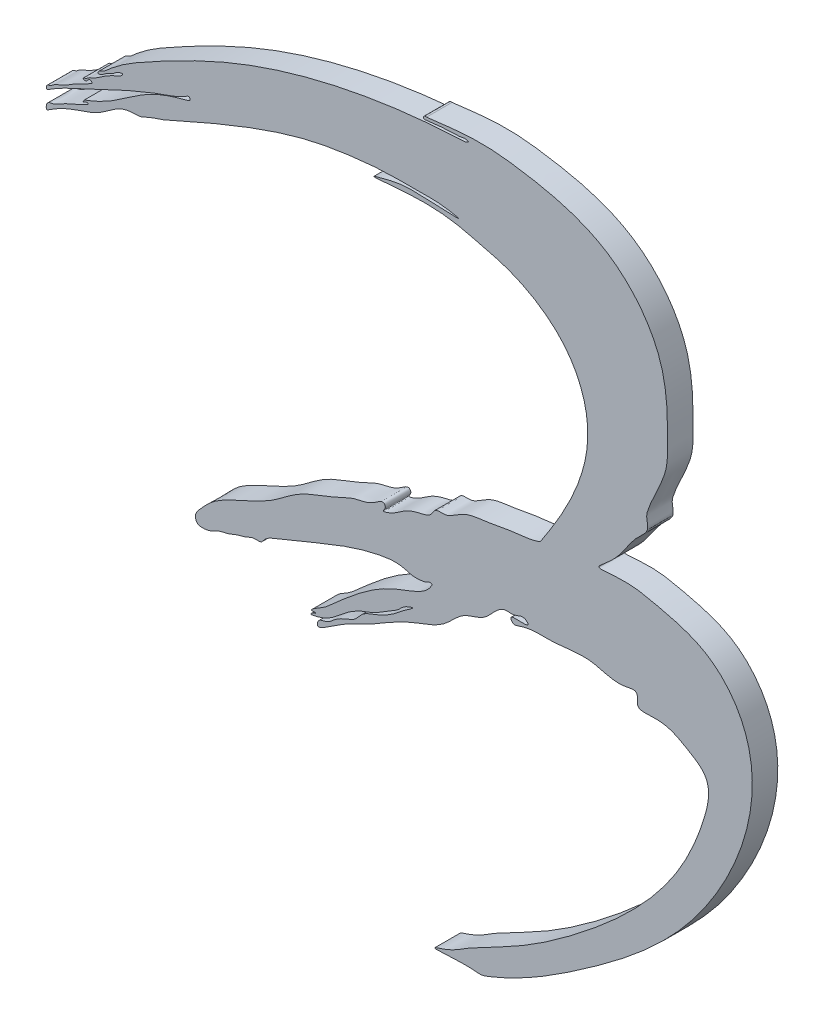
ISO-10303-21;
HEADER;
FILE_DESCRIPTION(('STEP AP214'),'2;1');
FILE_NAME('part.step','',(''),(''),'','','');
FILE_SCHEMA(('AUTOMOTIVE_DESIGN { 1 0 10303 214 1 1 1 1 }'));
ENDSEC;
DATA;
#1=APPLICATION_CONTEXT('core data for automotive mechanical design processes');
#2=APPLICATION_PROTOCOL_DEFINITION('international standard','automotive_design',2000,#1);
#3=PRODUCT_CONTEXT('',#1,'mechanical');
#4=PRODUCT('Part','Part','',(#3));
#5=PRODUCT_RELATED_PRODUCT_CATEGORY('part','',(#4));
#6=PRODUCT_DEFINITION_FORMATION('','',#4);
#7=PRODUCT_DEFINITION_CONTEXT('part definition',#1,'design');
#8=PRODUCT_DEFINITION('design','',#6,#7);
#9=PRODUCT_DEFINITION_SHAPE('','',#8);
#10=(LENGTH_UNIT() NAMED_UNIT(*) SI_UNIT(.MILLI.,.METRE.));
#11=(NAMED_UNIT(*) PLANE_ANGLE_UNIT() SI_UNIT($,.RADIAN.));
#12=(NAMED_UNIT(*) SI_UNIT($,.STERADIAN.) SOLID_ANGLE_UNIT());
#13=UNCERTAINTY_MEASURE_WITH_UNIT(LENGTH_MEASURE(1.E-05),#10,'distance_accuracy_value','');
#14=(GEOMETRIC_REPRESENTATION_CONTEXT(3) GLOBAL_UNCERTAINTY_ASSIGNED_CONTEXT((#13)) GLOBAL_UNIT_ASSIGNED_CONTEXT((#10,
#11,#12)) REPRESENTATION_CONTEXT('',''));
#15=CARTESIAN_POINT('',(0.,0.,0.));
#16=DIRECTION('',(0.,0.,1.));
#17=DIRECTION('',(1.,0.,0.));
#18=AXIS2_PLACEMENT_3D('',#15,#16,#17);
#19=CARTESIAN_POINT('',(15.1995015960389,5.19827013041804,3.));
#20=CARTESIAN_POINT('',(14.0958419529117,4.77396464165727,3.));
#21=CARTESIAN_POINT('',(11.9604295702762,4.71700979871829,3.));
#22=CARTESIAN_POINT('',(9.04787784690259,4.03560954435328,3.));
#23=CARTESIAN_POINT('',(6.52701310831833,3.87514311975151,3.));
#24=CARTESIAN_POINT('',(5.08191790555502,2.77374857367592,3.));
#25=CARTESIAN_POINT('',(3.93437140903093,2.2472457065042,3.));
#26=CARTESIAN_POINT('',(2.83011020224383,2.49890461831288,3.));
#27=CARTESIAN_POINT('',(2.36343260888996,1.30102953735953,3.));
#28=CARTESIAN_POINT('',(0.980198169077803,1.04895765775036,3.));
#29=CARTESIAN_POINT('',(-0.361872164064922,0.658241757764914,3.));
#30=CARTESIAN_POINT('',(-1.54804995635484,-0.183676376246237,3.));
#31=CARTESIAN_POINT('',(-2.19080340579083,-0.623235529355932,3.));
#32=CARTESIAN_POINT('',(-3.49299745831042,-1.06341475325133,3.));
#33=CARTESIAN_POINT('',(-2.91035248697116,-0.473377103082553,3.));
#34=CARTESIAN_POINT('',(-3.25038249949013,0.283024267710963,3.));
#35=CARTESIAN_POINT('',(-4.74300043955382,-1.07041505874894,3.));
#36=CARTESIAN_POINT('',(-6.62450668627817,-1.14249000049053,3.));
#37=CARTESIAN_POINT('',(-9.54150942046386,-2.72369646453109,3.));
#38=CARTESIAN_POINT('',(-13.0438725816569,-3.71720716387772,3.));
#39=CARTESIAN_POINT('',(-16.4090161860015,-6.66693622101617,3.));
#40=CARTESIAN_POINT('',(-20.0785110549887,-8.19699622163524,3.));
#41=CARTESIAN_POINT('',(-23.1946449837552,-9.69219821046574,3.));
#42=CARTESIAN_POINT('',(-24.5632220703858,-11.219945232225,3.));
#43=CARTESIAN_POINT('',(-25.4534214001273,-12.2065421290322,3.));
#44=CARTESIAN_POINT('',(-25.189023581123,-13.2096424038821,3.));
#45=CARTESIAN_POINT('',(-24.2647949861478,-13.2590205484727,3.));
#46=CARTESIAN_POINT('',(-23.3744817108042,-13.0606184347443,3.));
#47=CARTESIAN_POINT('',(-22.5545442981302,-12.5094396821662,3.));
#48=CARTESIAN_POINT('',(-21.420659909171,-12.376879658255,3.));
#49=CARTESIAN_POINT('',(-20.4958724052703,-11.8673714595925,3.));
#50=CARTESIAN_POINT('',(-19.3591896466576,-11.6660803361883,3.));
#51=CARTESIAN_POINT('',(-18.5537286594742,-11.1393079986086,3.));
#52=CARTESIAN_POINT('',(-17.6045090947666,-11.3772015076029,3.));
#53=CARTESIAN_POINT('',(-17.0866096849368,-10.5268866259645,3.));
#54=CARTESIAN_POINT('',(-15.1627246731678,-9.67361335865382,3.));
#55=CARTESIAN_POINT('',(-12.2172011838243,-8.53256594330222,3.));
#56=CARTESIAN_POINT('',(-8.05242348929606,-6.77304132352672,3.));
#57=CARTESIAN_POINT('',(-4.70448220639067,-5.71450819966082,3.));
#58=CARTESIAN_POINT('',(-2.06545377276401,-5.33522280448841,3.));
#59=CARTESIAN_POINT('',(-0.890788082645844,-5.42422225033863,3.));
#60=CARTESIAN_POINT('',(0.165009296190616,-5.81629201322624,3.));
#61=CARTESIAN_POINT('',(1.01124391583894,-5.76477608315352,3.));
#62=CARTESIAN_POINT('',(1.77711742775109,-5.67160042402953,3.));
#63=CARTESIAN_POINT('',(2.1035218855577,-5.35129102693235,3.));
#64=CARTESIAN_POINT('',(2.54953335853164,-5.45695972790596,3.));
#65=CARTESIAN_POINT('',(2.44625385237584,-5.62819552641706,3.));
#66=CARTESIAN_POINT('',(1.70468517378065,-6.95367896137805,3.));
#67=CARTESIAN_POINT('',(-2.32027920612268,-7.97560562476735,3.));
#68=CARTESIAN_POINT('',(-5.88242315110808,-10.4215725069074,3.));
#69=CARTESIAN_POINT('',(-8.58883850901547,-12.7742820257972,3.));
#70=CARTESIAN_POINT('',(-9.94585289846344,-14.0580035368671,3.));
#71=CARTESIAN_POINT('',(-10.9893006072624,-14.6309310794799,3.));
#72=CARTESIAN_POINT('',(-11.4147740086981,-14.907996669536,3.));
#73=CARTESIAN_POINT('',(-11.7803508659922,-15.2215829170252,3.));
#74=CARTESIAN_POINT('',(-11.4298349846787,-15.2538070675923,3.));
#75=CARTESIAN_POINT('',(-11.1862667639597,-15.1240886407105,3.));
#76=CARTESIAN_POINT('',(-11.2219141704161,-15.2912729898175,3.));
#77=B_SPLINE_CURVE_WITH_KNOTS('',3,(#19,#20,#21,#22,#23,#24,#25,#26,#27,#28,#29,#30,#31,#32,#33,
#34,#35,#36,#37,#38,#39,#40,#41,#42,#43,#44,#45,#46,#47,#48,#49,#50,#51,#52,#53,#54,#55,#56,#57,
#58,#59,#60,#61,#62,#63,#64,#65,#66,#67,#68,#69,#70,#71,#72,#73,#74,#75,#76),.UNSPECIFIED.,.F.,
.F.,(4,1,1,1,1,1,1,1,1,1,1,1,1,1,1,1,1,1,1,1,1,1,1,1,1,1,1,1,1,1,1,1,1,1,1,1,1,1,1,1,1,1,1,1,1,
1,1,1,1,1,1,1,1,1,1,4),(0.,0.0373110627141742,0.0671326128410842,0.0960530611719841,
0.115115706979997,0.123614158999246,0.136472614642831,0.143884529489868,0.159430477340161,
0.176825140254549,0.190211299430557,0.202319091711633,0.209924827147937,0.215168899995614,
0.218733740369436,0.232064775653565,0.25724223153123,0.286307385677385,0.332908069728579,
0.373258477766286,0.42579286996391,0.460063918038159,0.480885925202107,0.492042326306139,
0.499948532211395,0.507555739327661,0.517950483230059,0.529650547844752,0.537979896244193,
0.553818862893404,0.562715519574904,0.574430158171982,0.58371541189597,0.588441223917766,
0.603705009344641,0.64918787612356,0.690357062010263,0.747621402912072,0.76055054634767,
0.775211357613802,0.784692780123921,0.795926456972487,0.802181514557666,0.808231097726299,
0.81072967879181,0.811964274735067,0.813512594249906,0.861480588275613,0.925965587076256,
0.956206121477471,0.974515004402209,0.986662787159862,0.991349586606959,0.994374230531627,
0.996165229166199,1.),.UNSPECIFIED.);
#78=DIRECTION('',(0.,0.,-1.));
#79=VECTOR('',#78,1.);
#80=SURFACE_OF_LINEAR_EXTRUSION('',#77,#79);
#81=CARTESIAN_POINT('',(15.1995015960389,5.19827013041804,0.));
#82=CARTESIAN_POINT('',(14.0958419529117,4.77396464165727,0.));
#83=CARTESIAN_POINT('',(11.9604295702762,4.71700979871829,0.));
#84=CARTESIAN_POINT('',(9.04787784690259,4.03560954435328,0.));
#85=CARTESIAN_POINT('',(6.52701310831833,3.87514311975151,0.));
#86=CARTESIAN_POINT('',(5.08191790555502,2.77374857367592,0.));
#87=CARTESIAN_POINT('',(3.93437140903093,2.2472457065042,0.));
#88=CARTESIAN_POINT('',(2.83011020224383,2.49890461831288,0.));
#89=CARTESIAN_POINT('',(2.36343260888996,1.30102953735953,0.));
#90=CARTESIAN_POINT('',(0.980198169077803,1.04895765775036,0.));
#91=CARTESIAN_POINT('',(-0.361872164064922,0.658241757764914,0.));
#92=CARTESIAN_POINT('',(-1.54804995635484,-0.183676376246237,0.));
#93=CARTESIAN_POINT('',(-2.19080340579083,-0.623235529355932,0.));
#94=CARTESIAN_POINT('',(-3.49299745831042,-1.06341475325133,0.));
#95=CARTESIAN_POINT('',(-2.91035248697116,-0.473377103082553,0.));
#96=CARTESIAN_POINT('',(-3.25038249949013,0.283024267710963,0.));
#97=CARTESIAN_POINT('',(-4.74300043955382,-1.07041505874894,0.));
#98=CARTESIAN_POINT('',(-6.62450668627817,-1.14249000049053,0.));
#99=CARTESIAN_POINT('',(-9.54150942046386,-2.72369646453109,0.));
#100=CARTESIAN_POINT('',(-13.0438725816569,-3.71720716387772,0.));
#101=CARTESIAN_POINT('',(-16.4090161860015,-6.66693622101617,0.));
#102=CARTESIAN_POINT('',(-20.0785110549887,-8.19699622163524,0.));
#103=CARTESIAN_POINT('',(-23.1946449837552,-9.69219821046574,0.));
#104=CARTESIAN_POINT('',(-24.5632220703858,-11.219945232225,0.));
#105=CARTESIAN_POINT('',(-25.4534214001273,-12.2065421290322,0.));
#106=CARTESIAN_POINT('',(-25.189023581123,-13.2096424038821,0.));
#107=CARTESIAN_POINT('',(-24.2647949861478,-13.2590205484727,0.));
#108=CARTESIAN_POINT('',(-23.3744817108042,-13.0606184347443,0.));
#109=CARTESIAN_POINT('',(-22.5545442981302,-12.5094396821662,0.));
#110=CARTESIAN_POINT('',(-21.420659909171,-12.376879658255,0.));
#111=CARTESIAN_POINT('',(-20.4958724052703,-11.8673714595925,0.));
#112=CARTESIAN_POINT('',(-19.3591896466576,-11.6660803361883,0.));
#113=CARTESIAN_POINT('',(-18.5537286594742,-11.1393079986086,0.));
#114=CARTESIAN_POINT('',(-17.6045090947666,-11.3772015076029,0.));
#115=CARTESIAN_POINT('',(-17.0866096849368,-10.5268866259645,0.));
#116=CARTESIAN_POINT('',(-15.1627246731678,-9.67361335865382,0.));
#117=CARTESIAN_POINT('',(-12.2172011838243,-8.53256594330222,0.));
#118=CARTESIAN_POINT('',(-8.05242348929606,-6.77304132352672,0.));
#119=CARTESIAN_POINT('',(-4.70448220639067,-5.71450819966082,0.));
#120=CARTESIAN_POINT('',(-2.06545377276401,-5.33522280448841,0.));
#121=CARTESIAN_POINT('',(-0.890788082645844,-5.42422225033863,0.));
#122=CARTESIAN_POINT('',(0.165009296190616,-5.81629201322624,0.));
#123=CARTESIAN_POINT('',(1.01124391583894,-5.76477608315352,0.));
#124=CARTESIAN_POINT('',(1.77711742775109,-5.67160042402953,0.));
#125=CARTESIAN_POINT('',(2.1035218855577,-5.35129102693235,0.));
#126=CARTESIAN_POINT('',(2.54953335853164,-5.45695972790596,0.));
#127=CARTESIAN_POINT('',(2.44625385237584,-5.62819552641706,0.));
#128=CARTESIAN_POINT('',(1.70468517378065,-6.95367896137805,0.));
#129=CARTESIAN_POINT('',(-2.32027920612268,-7.97560562476735,0.));
#130=CARTESIAN_POINT('',(-5.88242315110808,-10.4215725069074,0.));
#131=CARTESIAN_POINT('',(-8.58883850901547,-12.7742820257972,0.));
#132=CARTESIAN_POINT('',(-9.94585289846344,-14.0580035368671,0.));
#133=CARTESIAN_POINT('',(-10.9893006072624,-14.6309310794799,0.));
#134=CARTESIAN_POINT('',(-11.4147740086981,-14.907996669536,0.));
#135=CARTESIAN_POINT('',(-11.7803508659922,-15.2215829170252,0.));
#136=CARTESIAN_POINT('',(-11.4298349846787,-15.2538070675923,0.));
#137=CARTESIAN_POINT('',(-11.1862667639597,-15.1240886407105,0.));
#138=CARTESIAN_POINT('',(-11.2219141704161,-15.2912729898175,0.));
#139=B_SPLINE_CURVE_WITH_KNOTS('',3,(#81,#82,#83,#84,#85,#86,#87,#88,#89,#90,#91,#92,#93,#94,
#95,#96,#97,#98,#99,#100,#101,#102,#103,#104,#105,#106,#107,#108,#109,#110,#111,#112,#113,#114,
#115,#116,#117,#118,#119,#120,#121,#122,#123,#124,#125,#126,#127,#128,#129,#130,#131,#132,#133,
#134,#135,#136,#137,#138),.UNSPECIFIED.,.F.,.F.,(4,1,1,1,1,1,1,1,1,1,1,1,1,1,1,1,1,1,1,1,1,1,1,
1,1,1,1,1,1,1,1,1,1,1,1,1,1,1,1,1,1,1,1,1,1,1,1,1,1,1,1,1,1,1,1,4),(0.,0.0373110627141742,
0.0671326128410842,0.0960530611719841,0.115115706979997,0.123614158999246,0.136472614642831,
0.143884529489868,0.159430477340161,0.176825140254549,0.190211299430557,0.202319091711633,
0.209924827147937,0.215168899995614,0.218733740369436,0.232064775653565,0.25724223153123,
0.286307385677385,0.332908069728579,0.373258477766286,0.42579286996391,0.460063918038159,
0.480885925202107,0.492042326306139,0.499948532211395,0.507555739327661,0.517950483230059,
0.529650547844752,0.537979896244193,0.553818862893404,0.562715519574904,0.574430158171982,
0.58371541189597,0.588441223917766,0.603705009344641,0.64918787612356,0.690357062010263,
0.747621402912072,0.76055054634767,0.775211357613802,0.784692780123921,0.795926456972487,
0.802181514557666,0.808231097726299,0.81072967879181,0.811964274735067,0.813512594249906,
0.861480588275613,0.925965587076256,0.956206121477471,0.974515004402209,0.986662787159862,
0.991349586606959,0.994374230531627,0.996165229166199,1.),.UNSPECIFIED.);
#140=CARTESIAN_POINT('',(15.1995015960389,5.19827013041804,0.));
#141=VERTEX_POINT('',#140);
#142=CARTESIAN_POINT('',(-11.221914170416,-15.2912729898174,0.));
#143=VERTEX_POINT('',#142);
#144=EDGE_CURVE('E160',#141,#143,#139,.T.);
#145=ORIENTED_EDGE('',*,*,#144,.T.);
#146=DIRECTION('',(0.,0.,-1.));
#147=VECTOR('',#146,1.);
#148=CARTESIAN_POINT('',(-11.221914170416,-15.2912729898174,3.));
#149=LINE('',#148,#147);
#150=CARTESIAN_POINT('',(-11.221914170416,-15.2912729898174,3.));
#151=VERTEX_POINT('',#150);
#152=EDGE_CURVE('E11',#151,#143,#149,.T.);
#153=ORIENTED_EDGE('',*,*,#152,.F.);
#154=CARTESIAN_POINT('',(15.1995015960389,5.19827013041804,3.));
#155=VERTEX_POINT('',#154);
#156=EDGE_CURVE('E132',#155,#151,#77,.T.);
#157=ORIENTED_EDGE('',*,*,#156,.F.);
#158=DIRECTION('',(0.,0.,-1.));
#159=VECTOR('',#158,1.);
#160=CARTESIAN_POINT('',(15.1995015960389,5.19827013041804,3.));
#161=LINE('',#160,#159);
#162=EDGE_CURVE('E104',#155,#141,#161,.T.);
#163=ORIENTED_EDGE('',*,*,#162,.T.);
#164=EDGE_LOOP('',(#145,#153,#157,#163));
#165=FACE_BOUND('',#164,.T.);
#166=ADVANCED_FACE('F33',(#165),#80,.F.);
#167=CARTESIAN_POINT('',(-11.221914170416,-15.2912729898174,3.));
#168=CARTESIAN_POINT('',(-11.5189389147028,-15.4279662597497,3.));
#169=CARTESIAN_POINT('',(-11.5254525217188,-15.3436418587691,3.));
#170=CARTESIAN_POINT('',(-11.8412727920546,-15.7007354015512,3.));
#171=CARTESIAN_POINT('',(-9.50659533725828,-15.3311738858664,3.));
#172=CARTESIAN_POINT('',(-8.41622893654678,-13.8050697630374,3.));
#173=CARTESIAN_POINT('',(-6.00838697655427,-12.3849518994164,3.));
#174=CARTESIAN_POINT('',(-4.13496059091193,-11.8054771202667,3.));
#175=CARTESIAN_POINT('',(-2.83709932965658,-10.8423829067835,3.));
#176=CARTESIAN_POINT('',(-1.39833603207282,-10.0762467828582,3.));
#177=CARTESIAN_POINT('',(-0.903376935939344,-9.34938670262808,3.));
#178=CARTESIAN_POINT('',(0.674975578002253,-8.80771598917175,3.));
#179=CARTESIAN_POINT('',(-1.02731392831293,-9.90382790486688,3.));
#180=CARTESIAN_POINT('',(-1.98193707320999,-10.8062916667545,3.));
#181=CARTESIAN_POINT('',(-3.86523492225404,-11.87561887977,3.));
#182=CARTESIAN_POINT('',(-5.67560417703189,-12.3758327723778,3.));
#183=CARTESIAN_POINT('',(-6.48225912013006,-13.6613219256212,3.));
#184=CARTESIAN_POINT('',(-7.79472109020774,-14.0916867510068,3.));
#185=CARTESIAN_POINT('',(-8.93406368649081,-14.7014686845481,3.));
#186=CARTESIAN_POINT('',(-9.79979626710272,-15.6219981916345,3.));
#187=CARTESIAN_POINT('',(-10.8685329267459,-15.5992016609686,3.));
#188=CARTESIAN_POINT('',(-11.1705494058274,-17.0193212386164,3.));
#189=CARTESIAN_POINT('',(-7.47431086954014,-14.2333126286844,3.));
#190=CARTESIAN_POINT('',(-5.01187801581852,-13.5414085973592,3.));
#191=CARTESIAN_POINT('',(-0.600839715638556,-10.4793844640075,3.));
#192=CARTESIAN_POINT('',(3.69857509671523,-9.52203095359924,3.));
#193=CARTESIAN_POINT('',(6.00859607265713,-6.49032616713004,3.));
#194=CARTESIAN_POINT('',(9.05293409071264,-6.10150546683464,3.));
#195=CARTESIAN_POINT('',(10.3479254439335,-3.53307837301929,3.));
#196=CARTESIAN_POINT('',(12.2506846288754,-3.95538168926402,3.));
#197=CARTESIAN_POINT('',(13.1512682595168,-3.20818858439633,3.));
#198=CARTESIAN_POINT('',(14.0634308772694,-4.0948958699519,3.));
#199=CARTESIAN_POINT('',(12.7327396377202,-4.10705784056804,3.));
#200=CARTESIAN_POINT('',(11.5299214393626,-4.0131400087814,3.));
#201=CARTESIAN_POINT('',(12.049471653755,-4.9091677715443,3.));
#202=CARTESIAN_POINT('',(13.8815600294986,-4.0912771187364,3.));
#203=CARTESIAN_POINT('',(16.7834393887847,-4.46436638409484,3.));
#204=CARTESIAN_POINT('',(21.2176079143435,-3.47339805468218,3.));
#205=CARTESIAN_POINT('',(24.0625462361234,-4.98014961688965,3.));
#206=CARTESIAN_POINT('',(26.5712180730074,-4.17148517881171,3.));
#207=CARTESIAN_POINT('',(26.681847386245,-5.11568379962877,3.));
#208=CARTESIAN_POINT('',(26.5193535224281,-6.23963142168466,3.));
#209=CARTESIAN_POINT('',(29.8199386362207,-5.72246045502405,3.));
#210=CARTESIAN_POINT('',(31.9442438773158,-6.93012012070608,3.));
#211=CARTESIAN_POINT('',(35.5820448130086,-9.07107017063939,3.));
#212=CARTESIAN_POINT('',(33.9289839560056,-16.0266111571874,3.));
#213=CARTESIAN_POINT('',(29.3750335532289,-24.2252762169431,3.));
#214=CARTESIAN_POINT('',(20.5245251812646,-32.0899727106418,3.));
#215=CARTESIAN_POINT('',(12.6535697896943,-37.455394119025,3.));
#216=CARTESIAN_POINT('',(7.03402707498904,-40.0833808790579,3.));
#217=CARTESIAN_POINT('',(4.73864640536638,-41.7174213074878,3.));
#218=CARTESIAN_POINT('',(1.75880281611782,-42.5436819355812,3.));
#219=CARTESIAN_POINT('',(5.50872826726006,-42.2747282896769,3.));
#220=CARTESIAN_POINT('',(6.96849178398661,-42.249871811036,3.));
#221=CARTESIAN_POINT('',(8.25690723821207,-42.4250067341725,3.));
#222=CARTESIAN_POINT('',(12.9895126695055,-40.6185857861391,3.));
#223=CARTESIAN_POINT('',(22.3913867667413,-34.6135419238202,3.));
#224=CARTESIAN_POINT('',(36.1886178459611,-23.566629926596,3.));
#225=CARTESIAN_POINT('',(42.8999015671345,-5.08038222634455,3.));
#226=CARTESIAN_POINT('',(35.0284879122134,4.19723738500187,3.));
#227=CARTESIAN_POINT('',(28.7122198396629,5.62982260987067,3.));
#228=CARTESIAN_POINT('',(25.5807075515508,6.33475332177753,3.));
#229=CARTESIAN_POINT('',(21.5114517749397,5.81991356136106,3.));
#230=CARTESIAN_POINT('',(23.8269878809401,7.58216980754947,3.));
#231=CARTESIAN_POINT('',(25.0043574726073,9.15425369060468,3.));
#232=CARTESIAN_POINT('',(26.4007504601684,11.268224294539,3.));
#233=CARTESIAN_POINT('',(28.1315208536264,12.6636892378337,3.));
#234=CARTESIAN_POINT('',(27.5873972972359,13.8730568166974,3.));
#235=CARTESIAN_POINT('',(28.323879586742,16.3403072862993,3.));
#236=CARTESIAN_POINT('',(30.1589169070215,19.1254859909862,3.));
#237=CARTESIAN_POINT('',(30.1747260721774,24.5163359537617,3.));
#238=CARTESIAN_POINT('',(30.2423610109516,31.0761530037512,3.));
#239=CARTESIAN_POINT('',(23.7545426891301,39.6068391039164,3.));
#240=CARTESIAN_POINT('',(15.3775378111352,41.6003830209233,3.));
#241=CARTESIAN_POINT('',(7.9652278516625,42.5436819355811,3.));
#242=CARTESIAN_POINT('',(4.20180004350573,42.0265488843957,3.));
#243=CARTESIAN_POINT('',(1.83862316989548,41.745802762924,3.));
#244=B_SPLINE_CURVE_WITH_KNOTS('',3,(#167,#168,#169,#170,#171,#172,#173,#174,#175,#176,#177,
#178,#179,#180,#181,#182,#183,#184,#185,#186,#187,#188,#189,#190,#191,#192,#193,#194,#195,#196,
#197,#198,#199,#200,#201,#202,#203,#204,#205,#206,#207,#208,#209,#210,#211,#212,#213,#214,#215,
#216,#217,#218,#219,#220,#221,#222,#223,#224,#225,#226,#227,#228,#229,#230,#231,#232,#233,#234,
#235,#236,#237,#238,#239,#240,#241,#242,#243),.UNSPECIFIED.,.F.,.F.,(4,1,1,1,1,1,1,1,1,1,1,1,1,
1,1,1,1,1,1,1,1,1,1,1,1,1,1,1,1,1,1,1,1,1,1,1,1,1,1,1,1,1,1,1,1,1,1,1,1,1,1,1,1,1,1,1,1,1,1,1,1,
1,1,1,1,1,1,1,1,1,1,1,1,1,4),(0.,0.00173731524768406,0.00249415689392807,0.00312388720845236,
0.0203729555138159,0.0277542138577279,0.032938611005887,0.0420648737710846,0.0457918866472484,
0.050242228136036,0.0533929358544633,0.0571555061634341,0.0633437778138226,0.0724573580782313,
0.0793573047019158,0.0835740670330145,0.0883413104196973,0.0941910483109437,0.0978151364573291,
0.102225639940641,0.103324234259138,0.11168663552729,0.128613965756466,0.146718539721065,
0.165606576677006,0.176758997813101,0.186161810638658,0.197939908750732,0.201137287867106,
0.206525870437159,0.208033129407301,0.211848087912277,0.215663046417252,0.217216693402016,
0.220425155321523,0.234079166336685,0.251949086554245,0.266721954632083,0.271251575046947,
0.2737081066228,0.275573244440685,0.282889663306661,0.297974023872584,0.307836209476271,
0.324630906382037,0.364913089714061,0.417495288428217,0.450972473809697,0.472882612226875,
0.482533458829873,0.487242414667897,0.496684654528719,0.503495758509468,0.50829182718403,
0.509976993942497,0.559555427086604,0.630289727712935,0.711218462108069,0.733900446002565,
0.757756541786665,0.776204067909898,0.781893340738878,0.786182077059615,0.798396566852196,
0.808520406347783,0.814174843335125,0.819827310456346,0.823005040537519,0.843402465968039,
0.849459629494909,0.881026997627402,0.916506526496646,0.958241489364952,0.973312959007756,1.),.UNSPECIFIED.);
#245=DIRECTION('',(0.,0.,-1.));
#246=VECTOR('',#245,1.);
#247=SURFACE_OF_LINEAR_EXTRUSION('',#244,#246);
#248=CARTESIAN_POINT('',(-11.221914170416,-15.2912729898174,0.));
#249=CARTESIAN_POINT('',(-11.5189389147028,-15.4279662597497,0.));
#250=CARTESIAN_POINT('',(-11.5254525217188,-15.3436418587691,0.));
#251=CARTESIAN_POINT('',(-11.8412727920546,-15.7007354015512,0.));
#252=CARTESIAN_POINT('',(-9.50659533725828,-15.3311738858664,0.));
#253=CARTESIAN_POINT('',(-8.41622893654678,-13.8050697630374,0.));
#254=CARTESIAN_POINT('',(-6.00838697655427,-12.3849518994164,0.));
#255=CARTESIAN_POINT('',(-4.13496059091193,-11.8054771202667,0.));
#256=CARTESIAN_POINT('',(-2.83709932965658,-10.8423829067835,0.));
#257=CARTESIAN_POINT('',(-1.39833603207282,-10.0762467828582,0.));
#258=CARTESIAN_POINT('',(-0.903376935939344,-9.34938670262808,0.));
#259=CARTESIAN_POINT('',(0.674975578002253,-8.80771598917175,0.));
#260=CARTESIAN_POINT('',(-1.02731392831293,-9.90382790486688,0.));
#261=CARTESIAN_POINT('',(-1.98193707320999,-10.8062916667545,0.));
#262=CARTESIAN_POINT('',(-3.86523492225404,-11.87561887977,0.));
#263=CARTESIAN_POINT('',(-5.67560417703189,-12.3758327723778,0.));
#264=CARTESIAN_POINT('',(-6.48225912013006,-13.6613219256212,0.));
#265=CARTESIAN_POINT('',(-7.79472109020774,-14.0916867510068,0.));
#266=CARTESIAN_POINT('',(-8.93406368649081,-14.7014686845481,0.));
#267=CARTESIAN_POINT('',(-9.79979626710272,-15.6219981916345,0.));
#268=CARTESIAN_POINT('',(-10.8685329267459,-15.5992016609686,0.));
#269=CARTESIAN_POINT('',(-11.1705494058274,-17.0193212386164,0.));
#270=CARTESIAN_POINT('',(-7.47431086954014,-14.2333126286844,0.));
#271=CARTESIAN_POINT('',(-5.01187801581852,-13.5414085973592,0.));
#272=CARTESIAN_POINT('',(-0.600839715638556,-10.4793844640075,0.));
#273=CARTESIAN_POINT('',(3.69857509671523,-9.52203095359924,0.));
#274=CARTESIAN_POINT('',(6.00859607265713,-6.49032616713004,0.));
#275=CARTESIAN_POINT('',(9.05293409071264,-6.10150546683464,0.));
#276=CARTESIAN_POINT('',(10.3479254439335,-3.53307837301929,0.));
#277=CARTESIAN_POINT('',(12.2506846288754,-3.95538168926402,0.));
#278=CARTESIAN_POINT('',(13.1512682595168,-3.20818858439633,0.));
#279=CARTESIAN_POINT('',(14.0634308772694,-4.0948958699519,0.));
#280=CARTESIAN_POINT('',(12.7327396377202,-4.10705784056804,0.));
#281=CARTESIAN_POINT('',(11.5299214393626,-4.0131400087814,0.));
#282=CARTESIAN_POINT('',(12.049471653755,-4.9091677715443,0.));
#283=CARTESIAN_POINT('',(13.8815600294986,-4.0912771187364,0.));
#284=CARTESIAN_POINT('',(16.7834393887847,-4.46436638409484,0.));
#285=CARTESIAN_POINT('',(21.2176079143435,-3.47339805468218,0.));
#286=CARTESIAN_POINT('',(24.0625462361234,-4.98014961688965,0.));
#287=CARTESIAN_POINT('',(26.5712180730074,-4.17148517881171,0.));
#288=CARTESIAN_POINT('',(26.681847386245,-5.11568379962877,0.));
#289=CARTESIAN_POINT('',(26.5193535224281,-6.23963142168466,0.));
#290=CARTESIAN_POINT('',(29.8199386362207,-5.72246045502405,0.));
#291=CARTESIAN_POINT('',(31.9442438773158,-6.93012012070608,0.));
#292=CARTESIAN_POINT('',(35.5820448130086,-9.07107017063939,0.));
#293=CARTESIAN_POINT('',(33.9289839560056,-16.0266111571874,0.));
#294=CARTESIAN_POINT('',(29.3750335532289,-24.2252762169431,0.));
#295=CARTESIAN_POINT('',(20.5245251812646,-32.0899727106418,0.));
#296=CARTESIAN_POINT('',(12.6535697896943,-37.455394119025,0.));
#297=CARTESIAN_POINT('',(7.03402707498904,-40.0833808790579,0.));
#298=CARTESIAN_POINT('',(4.73864640536638,-41.7174213074878,0.));
#299=CARTESIAN_POINT('',(1.75880281611782,-42.5436819355812,0.));
#300=CARTESIAN_POINT('',(5.50872826726006,-42.2747282896769,0.));
#301=CARTESIAN_POINT('',(6.96849178398661,-42.249871811036,0.));
#302=CARTESIAN_POINT('',(8.25690723821207,-42.4250067341725,0.));
#303=CARTESIAN_POINT('',(12.9895126695055,-40.6185857861391,0.));
#304=CARTESIAN_POINT('',(22.3913867667413,-34.6135419238202,0.));
#305=CARTESIAN_POINT('',(36.1886178459611,-23.566629926596,0.));
#306=CARTESIAN_POINT('',(42.8999015671345,-5.08038222634455,0.));
#307=CARTESIAN_POINT('',(35.0284879122134,4.19723738500187,0.));
#308=CARTESIAN_POINT('',(28.7122198396629,5.62982260987067,0.));
#309=CARTESIAN_POINT('',(25.5807075515508,6.33475332177753,0.));
#310=CARTESIAN_POINT('',(21.5114517749397,5.81991356136106,0.));
#311=CARTESIAN_POINT('',(23.8269878809401,7.58216980754947,0.));
#312=CARTESIAN_POINT('',(25.0043574726073,9.15425369060468,0.));
#313=CARTESIAN_POINT('',(26.4007504601684,11.268224294539,0.));
#314=CARTESIAN_POINT('',(28.1315208536264,12.6636892378337,0.));
#315=CARTESIAN_POINT('',(27.5873972972359,13.8730568166974,0.));
#316=CARTESIAN_POINT('',(28.323879586742,16.3403072862993,0.));
#317=CARTESIAN_POINT('',(30.1589169070215,19.1254859909862,0.));
#318=CARTESIAN_POINT('',(30.1747260721774,24.5163359537617,0.));
#319=CARTESIAN_POINT('',(30.2423610109516,31.0761530037512,0.));
#320=CARTESIAN_POINT('',(23.7545426891301,39.6068391039164,0.));
#321=CARTESIAN_POINT('',(15.3775378111352,41.6003830209233,0.));
#322=CARTESIAN_POINT('',(7.9652278516625,42.5436819355811,0.));
#323=CARTESIAN_POINT('',(4.20180004350573,42.0265488843957,0.));
#324=CARTESIAN_POINT('',(1.83862316989548,41.745802762924,0.));
#325=B_SPLINE_CURVE_WITH_KNOTS('',3,(#248,#249,#250,#251,#252,#253,#254,#255,#256,#257,#258,
#259,#260,#261,#262,#263,#264,#265,#266,#267,#268,#269,#270,#271,#272,#273,#274,#275,#276,#277,
#278,#279,#280,#281,#282,#283,#284,#285,#286,#287,#288,#289,#290,#291,#292,#293,#294,#295,#296,
#297,#298,#299,#300,#301,#302,#303,#304,#305,#306,#307,#308,#309,#310,#311,#312,#313,#314,#315,
#316,#317,#318,#319,#320,#321,#322,#323,#324),.UNSPECIFIED.,.F.,.F.,(4,1,1,1,1,1,1,1,1,1,1,1,1,
1,1,1,1,1,1,1,1,1,1,1,1,1,1,1,1,1,1,1,1,1,1,1,1,1,1,1,1,1,1,1,1,1,1,1,1,1,1,1,1,1,1,1,1,1,1,1,1,
1,1,1,1,1,1,1,1,1,1,1,1,1,4),(0.,0.00173731524768406,0.00249415689392807,0.00312388720845236,
0.0203729555138159,0.0277542138577279,0.032938611005887,0.0420648737710846,0.0457918866472484,
0.050242228136036,0.0533929358544633,0.0571555061634341,0.0633437778138226,0.0724573580782313,
0.0793573047019158,0.0835740670330145,0.0883413104196973,0.0941910483109437,0.0978151364573291,
0.102225639940641,0.103324234259138,0.11168663552729,0.128613965756466,0.146718539721065,
0.165606576677006,0.176758997813101,0.186161810638658,0.197939908750732,0.201137287867106,
0.206525870437159,0.208033129407301,0.211848087912277,0.215663046417252,0.217216693402016,
0.220425155321523,0.234079166336685,0.251949086554245,0.266721954632083,0.271251575046947,
0.2737081066228,0.275573244440685,0.282889663306661,0.297974023872584,0.307836209476271,
0.324630906382037,0.364913089714061,0.417495288428217,0.450972473809697,0.472882612226875,
0.482533458829873,0.487242414667897,0.496684654528719,0.503495758509468,0.50829182718403,
0.509976993942497,0.559555427086604,0.630289727712935,0.711218462108069,0.733900446002565,
0.757756541786665,0.776204067909898,0.781893340738878,0.786182077059615,0.798396566852196,
0.808520406347783,0.814174843335125,0.819827310456346,0.823005040537519,0.843402465968039,
0.849459629494909,0.881026997627402,0.916506526496646,0.958241489364952,0.973312959007756,1.),.UNSPECIFIED.);
#326=CARTESIAN_POINT('',(1.83862316989549,41.745802762924,0.));
#327=VERTEX_POINT('',#326);
#328=EDGE_CURVE('E159',#143,#327,#325,.T.);
#329=ORIENTED_EDGE('',*,*,#328,.T.);
#330=DIRECTION('',(0.,0.,-1.));
#331=VECTOR('',#330,1.);
#332=CARTESIAN_POINT('',(1.83862316989549,41.745802762924,3.));
#333=LINE('',#332,#331);
#334=CARTESIAN_POINT('',(1.83862316989549,41.745802762924,3.));
#335=VERTEX_POINT('',#334);
#336=EDGE_CURVE('E42',#335,#327,#333,.T.);
#337=ORIENTED_EDGE('',*,*,#336,.F.);
#338=EDGE_CURVE('E84',#151,#335,#244,.T.);
#339=ORIENTED_EDGE('',*,*,#338,.F.);
#340=ORIENTED_EDGE('',*,*,#152,.T.);
#341=EDGE_LOOP('',(#329,#337,#339,#340));
#342=FACE_BOUND('',#341,.T.);
#343=ADVANCED_FACE('F127',(#342),#247,.F.);
#344=CARTESIAN_POINT('',(1.83862316989549,41.745802762924,3.));
#345=CARTESIAN_POINT('',(1.6622858762715,41.745802762924,3.));
#346=CARTESIAN_POINT('',(1.55165481795354,41.7597905886907,3.));
#347=CARTESIAN_POINT('',(1.42332824912486,41.4786273441266,3.));
#348=CARTESIAN_POINT('',(1.6078737797498,41.3840833642732,3.));
#349=CARTESIAN_POINT('',(2.67182051288773,41.5875783587048,3.));
#350=CARTESIAN_POINT('',(4.76080381802327,41.6879963129292,3.));
#351=CARTESIAN_POINT('',(4.77463910873505,41.6752678454744,3.));
#352=B_SPLINE_CURVE_WITH_KNOTS('',3,(#344,#345,#346,#347,#348,#349,#350,#351),.UNSPECIFIED.,.F.,
.F.,(4,1,1,1,1,4),(0.,0.0825060917504985,0.133215226776818,0.174158315026388,0.210899239204021,
1.),.UNSPECIFIED.);
#353=DIRECTION('',(0.,0.,-1.));
#354=VECTOR('',#353,1.);
#355=SURFACE_OF_LINEAR_EXTRUSION('',#352,#354);
#356=CARTESIAN_POINT('',(1.83862316989549,41.745802762924,0.));
#357=CARTESIAN_POINT('',(1.6622858762715,41.745802762924,0.));
#358=CARTESIAN_POINT('',(1.55165481795354,41.7597905886907,0.));
#359=CARTESIAN_POINT('',(1.42332824912486,41.4786273441266,0.));
#360=CARTESIAN_POINT('',(1.6078737797498,41.3840833642732,0.));
#361=CARTESIAN_POINT('',(2.67182051288773,41.5875783587048,0.));
#362=CARTESIAN_POINT('',(4.76080381802327,41.6879963129292,0.));
#363=CARTESIAN_POINT('',(4.77463910873505,41.6752678454744,0.));
#364=B_SPLINE_CURVE_WITH_KNOTS('',3,(#356,#357,#358,#359,#360,#361,#362,#363),.UNSPECIFIED.,.F.,
.F.,(4,1,1,1,1,4),(0.,0.0825060917504985,0.133215226776818,0.174158315026388,0.210899239204021,
1.),.UNSPECIFIED.);
#365=CARTESIAN_POINT('',(4.77463910873501,41.6752678454744,0.));
#366=VERTEX_POINT('',#365);
#367=EDGE_CURVE('E99',#327,#366,#364,.T.);
#368=ORIENTED_EDGE('',*,*,#367,.T.);
#369=DIRECTION('',(0.,0.,-1.));
#370=VECTOR('',#369,1.);
#371=CARTESIAN_POINT('',(4.77463910873501,41.6752678454744,3.));
#372=LINE('',#371,#370);
#373=CARTESIAN_POINT('',(4.77463910873501,41.6752678454744,3.));
#374=VERTEX_POINT('',#373);
#375=EDGE_CURVE('E96',#374,#366,#372,.T.);
#376=ORIENTED_EDGE('',*,*,#375,.F.);
#377=EDGE_CURVE('E88',#335,#374,#352,.T.);
#378=ORIENTED_EDGE('',*,*,#377,.F.);
#379=ORIENTED_EDGE('',*,*,#336,.T.);
#380=EDGE_LOOP('',(#368,#376,#378,#379));
#381=FACE_BOUND('',#380,.T.);
#382=ADVANCED_FACE('F97',(#381),#355,.F.);
#383=CARTESIAN_POINT('',(4.77463910873501,41.6752678454744,3.));
#384=CARTESIAN_POINT('',(5.06097920652878,41.7083070875275,3.));
#385=CARTESIAN_POINT('',(5.82291470013701,41.6651505531661,3.));
#386=CARTESIAN_POINT('',(6.34482505756071,41.8830951753097,3.));
#387=CARTESIAN_POINT('',(6.81693483428857,41.7185029012533,3.));
#388=CARTESIAN_POINT('',(6.57330663442508,41.5352558577441,3.));
#389=CARTESIAN_POINT('',(6.3768307377883,41.498112845863,3.));
#390=CARTESIAN_POINT('',(4.57388912045521,41.4197903547801,3.));
#391=CARTESIAN_POINT('',(-4.49586713086853,40.8022086372034,3.));
#392=CARTESIAN_POINT('',(-17.4704433363036,37.9478508683895,3.));
#393=CARTESIAN_POINT('',(-28.9884502268893,32.1303364631588,3.));
#394=CARTESIAN_POINT('',(-34.0123288860627,29.2498971997952,3.));
#395=CARTESIAN_POINT('',(-35.5899052090262,27.873454299659,3.));
#396=CARTESIAN_POINT('',(-36.1706846750749,27.3703622458175,3.));
#397=CARTESIAN_POINT('',(-36.6708793336448,27.2902503953966,3.));
#398=CARTESIAN_POINT('',(-36.801377521324,26.8789232027454,3.));
#399=CARTESIAN_POINT('',(-36.3188986996834,26.8954804358521,3.));
#400=CARTESIAN_POINT('',(-35.9273273088677,27.3907627541308,3.));
#401=CARTESIAN_POINT('',(-34.9214939864112,27.6802126943677,3.));
#402=CARTESIAN_POINT('',(-34.5744835887522,28.2131680136287,3.));
#403=CARTESIAN_POINT('',(-33.7846423784101,28.3325938730294,3.));
#404=CARTESIAN_POINT('',(-34.0914360335709,27.9358394951381,3.));
#405=CARTESIAN_POINT('',(-34.8495328958717,27.6549856389498,3.));
#406=CARTESIAN_POINT('',(-36.0327797086853,27.0208175915366,3.));
#407=CARTESIAN_POINT('',(-37.032948019983,26.2424661000758,3.));
#408=CARTESIAN_POINT('',(-37.8694642045655,25.9445450152169,3.));
#409=CARTESIAN_POINT('',(-38.1499272535662,25.6419395491601,3.));
#410=CARTESIAN_POINT('',(-38.6207042462,25.5703833247246,3.));
#411=CARTESIAN_POINT('',(-38.2784490340423,25.3248682770435,3.));
#412=CARTESIAN_POINT('',(-38.0009330131226,25.5362746218252,3.));
#413=CARTESIAN_POINT('',(-37.7707305380655,25.8764277230248,3.));
#414=CARTESIAN_POINT('',(-37.3581371688816,25.5580942555282,3.));
#415=CARTESIAN_POINT('',(-37.8536374168492,25.3198813462891,3.));
#416=CARTESIAN_POINT('',(-38.4615113872964,24.9110898924138,3.));
#417=CARTESIAN_POINT('',(-39.6988277792529,24.4092151931075,3.));
#418=CARTESIAN_POINT('',(-40.8146030769645,23.5681193976286,3.));
#419=CARTESIAN_POINT('',(-41.8603751743773,23.2955836024323,3.));
#420=CARTESIAN_POINT('',(-42.348259231615,22.7941418714101,3.));
#421=CARTESIAN_POINT('',(-42.8538290738016,22.7923062227483,3.));
#422=CARTESIAN_POINT('',(-42.8741103087588,22.1503913579897,3.));
#423=CARTESIAN_POINT('',(-41.3098698591656,23.1962562356976,3.));
#424=CARTESIAN_POINT('',(-38.8592042846149,24.2229449444338,3.));
#425=CARTESIAN_POINT('',(-34.1379782117243,26.5782704525587,3.));
#426=CARTESIAN_POINT('',(-30.1411160096328,28.2525540632906,3.));
#427=CARTESIAN_POINT('',(-27.3605217446482,29.1655252404159,3.));
#428=CARTESIAN_POINT('',(-26.5075534280876,29.6929952135038,3.));
#429=CARTESIAN_POINT('',(-26.103538738174,29.9304922559699,3.));
#430=CARTESIAN_POINT('',(-25.7879818419114,29.4979553469434,3.));
#431=CARTESIAN_POINT('',(-32.8099206728159,27.8722486441838,3.));
#432=CARTESIAN_POINT('',(-33.1515009064001,25.2716613102999,3.));
#433=CARTESIAN_POINT('',(-38.3786821040045,23.3819707761235,3.));
#434=B_SPLINE_CURVE_WITH_KNOTS('',3,(#383,#384,#385,#386,#387,#388,#389,#390,#391,#392,#393,
#394,#395,#396,#397,#398,#399,#400,#401,#402,#403,#404,#405,#406,#407,#408,#409,#410,#411,#412,
#413,#414,#415,#416,#417,#418,#419,#420,#421,#422,#423,#424,#425,#426,#427,#428,#429,#430,#431,
#432,#433),.UNSPECIFIED.,.F.,.F.,(4,1,1,1,1,1,1,1,1,1,1,1,1,1,1,1,1,1,1,1,1,1,1,1,1,1,1,1,1,1,1,
1,1,1,1,1,1,1,1,1,1,1,1,1,1,1,1,1,4),(0.,0.0114183065529457,0.0186675737254903,
0.0205298343827471,0.0220646414273483,0.0254690561903965,0.0274479867377989,0.0766714196230974,
0.308023088277966,0.426094838312351,0.474335905025616,0.484804499217953,0.490684236102368,
0.49771474424871,0.499162531873214,0.500815924887124,0.508783414540374,0.519536311900476,
0.529047974929038,0.532499189808912,0.534050856591378,0.541052093957214,0.559421303020798,
0.573486851145742,0.580904776310274,0.584897345710172,0.587944165498265,0.589695994539984,
0.594013569644109,0.597250921189483,0.600633747367379,0.603087147968486,0.610231558359883,
0.626251653188634,0.64192814109731,0.653415197552848,0.658369649529797,0.662760573398402,
0.666806825326531,0.669254498736839,0.707798976504085,0.765322389440836,0.821932484501013,
0.845819622563151,0.851361227530017,0.855398360752344,0.856965763332636,0.865152420865945,1.),.UNSPECIFIED.);
#435=DIRECTION('',(0.,0.,-1.));
#436=VECTOR('',#435,1.);
#437=SURFACE_OF_LINEAR_EXTRUSION('',#434,#436);
#438=CARTESIAN_POINT('',(4.77463910873501,41.6752678454744,0.));
#439=CARTESIAN_POINT('',(5.06097920652878,41.7083070875275,0.));
#440=CARTESIAN_POINT('',(5.82291470013701,41.6651505531661,0.));
#441=CARTESIAN_POINT('',(6.34482505756071,41.8830951753097,0.));
#442=CARTESIAN_POINT('',(6.81693483428857,41.7185029012533,0.));
#443=CARTESIAN_POINT('',(6.57330663442508,41.5352558577441,0.));
#444=CARTESIAN_POINT('',(6.3768307377883,41.498112845863,0.));
#445=CARTESIAN_POINT('',(4.57388912045521,41.4197903547801,0.));
#446=CARTESIAN_POINT('',(-4.49586713086853,40.8022086372034,0.));
#447=CARTESIAN_POINT('',(-17.4704433363036,37.9478508683895,0.));
#448=CARTESIAN_POINT('',(-28.9884502268893,32.1303364631588,0.));
#449=CARTESIAN_POINT('',(-34.0123288860627,29.2498971997952,0.));
#450=CARTESIAN_POINT('',(-35.5899052090262,27.873454299659,0.));
#451=CARTESIAN_POINT('',(-36.1706846750749,27.3703622458175,0.));
#452=CARTESIAN_POINT('',(-36.6708793336448,27.2902503953966,0.));
#453=CARTESIAN_POINT('',(-36.801377521324,26.8789232027454,0.));
#454=CARTESIAN_POINT('',(-36.3188986996834,26.8954804358521,0.));
#455=CARTESIAN_POINT('',(-35.9273273088677,27.3907627541308,0.));
#456=CARTESIAN_POINT('',(-34.9214939864112,27.6802126943677,0.));
#457=CARTESIAN_POINT('',(-34.5744835887522,28.2131680136287,0.));
#458=CARTESIAN_POINT('',(-33.7846423784101,28.3325938730294,0.));
#459=CARTESIAN_POINT('',(-34.0914360335709,27.9358394951381,0.));
#460=CARTESIAN_POINT('',(-34.8495328958717,27.6549856389498,0.));
#461=CARTESIAN_POINT('',(-36.0327797086853,27.0208175915366,0.));
#462=CARTESIAN_POINT('',(-37.032948019983,26.2424661000758,0.));
#463=CARTESIAN_POINT('',(-37.8694642045655,25.9445450152169,0.));
#464=CARTESIAN_POINT('',(-38.1499272535662,25.6419395491601,0.));
#465=CARTESIAN_POINT('',(-38.6207042462,25.5703833247246,0.));
#466=CARTESIAN_POINT('',(-38.2784490340423,25.3248682770435,0.));
#467=CARTESIAN_POINT('',(-38.0009330131226,25.5362746218252,0.));
#468=CARTESIAN_POINT('',(-37.7707305380655,25.8764277230248,0.));
#469=CARTESIAN_POINT('',(-37.3581371688816,25.5580942555282,0.));
#470=CARTESIAN_POINT('',(-37.8536374168492,25.3198813462891,0.));
#471=CARTESIAN_POINT('',(-38.4615113872964,24.9110898924138,0.));
#472=CARTESIAN_POINT('',(-39.6988277792529,24.4092151931075,0.));
#473=CARTESIAN_POINT('',(-40.8146030769645,23.5681193976286,0.));
#474=CARTESIAN_POINT('',(-41.8603751743773,23.2955836024323,0.));
#475=CARTESIAN_POINT('',(-42.348259231615,22.7941418714101,0.));
#476=CARTESIAN_POINT('',(-42.8538290738016,22.7923062227483,0.));
#477=CARTESIAN_POINT('',(-42.8741103087588,22.1503913579897,0.));
#478=CARTESIAN_POINT('',(-41.3098698591656,23.1962562356976,0.));
#479=CARTESIAN_POINT('',(-38.8592042846149,24.2229449444338,0.));
#480=CARTESIAN_POINT('',(-34.1379782117243,26.5782704525587,0.));
#481=CARTESIAN_POINT('',(-30.1411160096328,28.2525540632906,0.));
#482=CARTESIAN_POINT('',(-27.3605217446482,29.1655252404159,0.));
#483=CARTESIAN_POINT('',(-26.5075534280876,29.6929952135038,0.));
#484=CARTESIAN_POINT('',(-26.103538738174,29.9304922559699,0.));
#485=CARTESIAN_POINT('',(-25.7879818419114,29.4979553469434,0.));
#486=CARTESIAN_POINT('',(-32.8099206728159,27.8722486441838,0.));
#487=CARTESIAN_POINT('',(-33.1515009064001,25.2716613102999,0.));
#488=CARTESIAN_POINT('',(-38.3786821040045,23.3819707761235,0.));
#489=B_SPLINE_CURVE_WITH_KNOTS('',3,(#438,#439,#440,#441,#442,#443,#444,#445,#446,#447,#448,
#449,#450,#451,#452,#453,#454,#455,#456,#457,#458,#459,#460,#461,#462,#463,#464,#465,#466,#467,
#468,#469,#470,#471,#472,#473,#474,#475,#476,#477,#478,#479,#480,#481,#482,#483,#484,#485,#486,
#487,#488),.UNSPECIFIED.,.F.,.F.,(4,1,1,1,1,1,1,1,1,1,1,1,1,1,1,1,1,1,1,1,1,1,1,1,1,1,1,1,1,1,1,
1,1,1,1,1,1,1,1,1,1,1,1,1,1,1,1,1,4),(0.,0.0114183065529457,0.0186675737254903,
0.0205298343827471,0.0220646414273483,0.0254690561903965,0.0274479867377989,0.0766714196230974,
0.308023088277966,0.426094838312351,0.474335905025616,0.484804499217953,0.490684236102368,
0.49771474424871,0.499162531873214,0.500815924887124,0.508783414540374,0.519536311900476,
0.529047974929038,0.532499189808912,0.534050856591378,0.541052093957214,0.559421303020798,
0.573486851145742,0.580904776310274,0.584897345710172,0.587944165498265,0.589695994539984,
0.594013569644109,0.597250921189483,0.600633747367379,0.603087147968486,0.610231558359883,
0.626251653188634,0.64192814109731,0.653415197552848,0.658369649529797,0.662760573398402,
0.666806825326531,0.669254498736839,0.707798976504085,0.765322389440836,0.821932484501013,
0.845819622563151,0.851361227530017,0.855398360752344,0.856965763332636,0.865152420865945,1.),.UNSPECIFIED.);
#490=CARTESIAN_POINT('',(-38.3786821040045,23.3819707761235,0.));
#491=VERTEX_POINT('',#490);
#492=EDGE_CURVE('E70',#366,#491,#489,.T.);
#493=ORIENTED_EDGE('',*,*,#492,.T.);
#494=DIRECTION('',(0.,0.,-1.));
#495=VECTOR('',#494,1.);
#496=CARTESIAN_POINT('',(-38.3786821040045,23.3819707761235,3.));
#497=LINE('',#496,#495);
#498=CARTESIAN_POINT('',(-38.3786821040045,23.3819707761235,3.));
#499=VERTEX_POINT('',#498);
#500=EDGE_CURVE('E100',#499,#491,#497,.T.);
#501=ORIENTED_EDGE('',*,*,#500,.F.);
#502=EDGE_CURVE('E92',#374,#499,#434,.T.);
#503=ORIENTED_EDGE('',*,*,#502,.F.);
#504=ORIENTED_EDGE('',*,*,#375,.T.);
#505=EDGE_LOOP('',(#493,#501,#503,#504));
#506=FACE_BOUND('',#505,.T.);
#507=ADVANCED_FACE('F102',(#506),#437,.F.);
#508=CARTESIAN_POINT('',(-38.3786821040045,23.3819707761235,3.));
#509=CARTESIAN_POINT('',(-38.3818612792817,23.3767595784315,3.));
#510=CARTESIAN_POINT('',(-38.4533017789839,23.2593349971396,3.));
#511=CARTESIAN_POINT('',(-38.6200725842508,22.967870193368,3.));
#512=CARTESIAN_POINT('',(-38.2288265530699,23.3431853497177,3.));
#513=CARTESIAN_POINT('',(-37.8226867971546,23.2230271372357,3.));
#514=CARTESIAN_POINT('',(-39.3828383252714,22.3532918057887,3.));
#515=CARTESIAN_POINT('',(-40.4552720749239,22.1003236865669,3.));
#516=CARTESIAN_POINT('',(-41.9364511378889,21.0755156306795,3.));
#517=CARTESIAN_POINT('',(-42.8716084911099,21.122992506014,3.));
#518=CARTESIAN_POINT('',(-42.8999015671345,20.0599804560944,3.));
#519=CARTESIAN_POINT('',(-41.5025418129659,21.0173016991026,3.));
#520=CARTESIAN_POINT('',(-39.7118735973248,21.8310023577605,3.));
#521=CARTESIAN_POINT('',(-36.0404877729027,22.8858363422614,3.));
#522=CARTESIAN_POINT('',(-34.3862343236637,24.9650982209316,3.));
#523=CARTESIAN_POINT('',(-32.3922925277131,24.9087072235508,3.));
#524=CARTESIAN_POINT('',(-31.4982201228312,25.0132682865165,3.));
#525=CARTESIAN_POINT('',(-30.790313218274,25.4641722794513,3.));
#526=CARTESIAN_POINT('',(-29.2959581623913,25.8996565944114,3.));
#527=CARTESIAN_POINT('',(-26.7015567473115,27.0577282342543,3.));
#528=CARTESIAN_POINT('',(-15.920033060133,31.9326974867907,3.));
#529=CARTESIAN_POINT('',(-7.44584547661562,33.3664292447831,3.));
#530=CARTESIAN_POINT('',(-2.6472362445551,33.7992936656045,3.));
#531=CARTESIAN_POINT('',(1.01799333588219,33.6897931673733,3.));
#532=CARTESIAN_POINT('',(3.14168444903552,33.8324055391935,3.));
#533=CARTESIAN_POINT('',(7.30275744112878,33.0777354788736,3.));
#534=CARTESIAN_POINT('',(0.118090620469042,33.6057320996083,3.));
#535=CARTESIAN_POINT('',(-1.58227748957155,33.3860295114143,3.));
#536=CARTESIAN_POINT('',(-5.77051202758936,32.3249437281487,3.));
#537=CARTESIAN_POINT('',(3.43356806633422,33.434127810861,3.));
#538=CARTESIAN_POINT('',(6.46714202159654,32.3361544616506,3.));
#539=CARTESIAN_POINT('',(12.5531659442524,30.8998655225799,3.));
#540=CARTESIAN_POINT('',(18.5874476922017,27.5011425323727,3.));
#541=CARTESIAN_POINT('',(22.6290009489304,16.9712274562156,3.));
#542=CARTESIAN_POINT('',(17.8218338752113,9.18338327544749,3.));
#543=CARTESIAN_POINT('',(15.1995015960389,5.19827013041804,3.));
#544=B_SPLINE_CURVE_WITH_KNOTS('',3,(#508,#509,#510,#511,#512,#513,#514,#515,#516,#517,#518,
#519,#520,#521,#522,#523,#524,#525,#526,#527,#528,#529,#530,#531,#532,#533,#534,#535,#536,#537,
#538,#539,#540,#541,#542,#543),.UNSPECIFIED.,.F.,.F.,(4,1,1,1,1,1,1,1,1,1,1,1,1,1,1,1,1,1,1,1,1,
1,1,1,1,1,1,1,1,1,1,1,1,4),(0.,0.000429019344501125,0.00965039540171042,0.0230531508132169,
0.0305588071374432,0.0371603077546583,0.1505916671302,0.180561139316133,0.209151123148488,
0.228766877993967,0.235682910036875,0.348381373471097,0.450862455432744,0.591404861218009,
0.605270558708062,0.608092710008112,0.618344855972908,0.620639112948844,0.629753761521876,
0.66611315810245,0.68254236895171,0.692714882998203,0.699913723179896,0.707224891893168,
0.710570795370397,0.720626860081922,0.729613338039062,0.733344220159236,0.741972052040982,
0.764034956642954,0.76856761640166,0.787298649628045,0.803416923791308,0.83753509718641),.UNSPECIFIED.);
#545=DIRECTION('',(0.,0.,-1.));
#546=VECTOR('',#545,1.);
#547=SURFACE_OF_LINEAR_EXTRUSION('',#544,#546);
#548=CARTESIAN_POINT('',(-38.3786821040045,23.3819707761235,0.));
#549=CARTESIAN_POINT('',(-38.3818612792817,23.3767595784315,0.));
#550=CARTESIAN_POINT('',(-38.4533017789839,23.2593349971396,0.));
#551=CARTESIAN_POINT('',(-38.6200725842508,22.967870193368,0.));
#552=CARTESIAN_POINT('',(-38.2288265530699,23.3431853497177,0.));
#553=CARTESIAN_POINT('',(-37.8226867971546,23.2230271372357,0.));
#554=CARTESIAN_POINT('',(-39.3828383252714,22.3532918057887,0.));
#555=CARTESIAN_POINT('',(-40.4552720749239,22.1003236865669,0.));
#556=CARTESIAN_POINT('',(-41.9364511378889,21.0755156306795,0.));
#557=CARTESIAN_POINT('',(-42.8716084911099,21.122992506014,0.));
#558=CARTESIAN_POINT('',(-42.8999015671345,20.0599804560944,0.));
#559=CARTESIAN_POINT('',(-41.5025418129659,21.0173016991026,0.));
#560=CARTESIAN_POINT('',(-39.7118735973248,21.8310023577605,0.));
#561=CARTESIAN_POINT('',(-36.0404877729027,22.8858363422614,0.));
#562=CARTESIAN_POINT('',(-34.3862343236637,24.9650982209316,0.));
#563=CARTESIAN_POINT('',(-32.3922925277131,24.9087072235508,0.));
#564=CARTESIAN_POINT('',(-31.4982201228312,25.0132682865165,0.));
#565=CARTESIAN_POINT('',(-30.790313218274,25.4641722794513,0.));
#566=CARTESIAN_POINT('',(-29.2959581623913,25.8996565944114,0.));
#567=CARTESIAN_POINT('',(-26.7015567473115,27.0577282342543,0.));
#568=CARTESIAN_POINT('',(-15.920033060133,31.9326974867907,0.));
#569=CARTESIAN_POINT('',(-7.44584547661562,33.3664292447831,0.));
#570=CARTESIAN_POINT('',(-2.6472362445551,33.7992936656045,0.));
#571=CARTESIAN_POINT('',(1.01799333588219,33.6897931673733,0.));
#572=CARTESIAN_POINT('',(3.14168444903552,33.8324055391935,0.));
#573=CARTESIAN_POINT('',(7.30275744112878,33.0777354788736,0.));
#574=CARTESIAN_POINT('',(0.118090620469042,33.6057320996083,0.));
#575=CARTESIAN_POINT('',(-1.58227748957155,33.3860295114143,0.));
#576=CARTESIAN_POINT('',(-5.77051202758936,32.3249437281487,0.));
#577=CARTESIAN_POINT('',(3.43356806633422,33.434127810861,0.));
#578=CARTESIAN_POINT('',(6.46714202159654,32.3361544616506,0.));
#579=CARTESIAN_POINT('',(12.5531659442524,30.8998655225799,0.));
#580=CARTESIAN_POINT('',(18.5874476922017,27.5011425323727,0.));
#581=CARTESIAN_POINT('',(22.6290009489304,16.9712274562156,0.));
#582=CARTESIAN_POINT('',(17.8218338752113,9.18338327544749,0.));
#583=CARTESIAN_POINT('',(15.1995015960389,5.19827013041804,0.));
#584=B_SPLINE_CURVE_WITH_KNOTS('',3,(#548,#549,#550,#551,#552,#553,#554,#555,#556,#557,#558,
#559,#560,#561,#562,#563,#564,#565,#566,#567,#568,#569,#570,#571,#572,#573,#574,#575,#576,#577,
#578,#579,#580,#581,#582,#583),.UNSPECIFIED.,.F.,.F.,(4,1,1,1,1,1,1,1,1,1,1,1,1,1,1,1,1,1,1,1,1,
1,1,1,1,1,1,1,1,1,1,1,1,4),(0.,0.000429019344501125,0.00965039540171042,0.0230531508132169,
0.0305588071374432,0.0371603077546583,0.1505916671302,0.180561139316133,0.209151123148488,
0.228766877993967,0.235682910036875,0.348381373471097,0.450862455432744,0.591404861218009,
0.605270558708062,0.608092710008112,0.618344855972908,0.620639112948844,0.629753761521876,
0.66611315810245,0.68254236895171,0.692714882998203,0.699913723179896,0.707224891893168,
0.710570795370397,0.720626860081922,0.729613338039062,0.733344220159236,0.741972052040982,
0.764034956642954,0.76856761640166,0.787298649628045,0.803416923791308,0.83753509718641),.UNSPECIFIED.);
#585=EDGE_CURVE('E76',#491,#141,#584,.T.);
#586=ORIENTED_EDGE('',*,*,#585,.T.);
#587=ORIENTED_EDGE('',*,*,#162,.F.);
#588=EDGE_CURVE('E50',#499,#155,#544,.T.);
#589=ORIENTED_EDGE('',*,*,#588,.F.);
#590=ORIENTED_EDGE('',*,*,#500,.T.);
#591=EDGE_LOOP('',(#586,#587,#589,#590));
#592=FACE_BOUND('',#591,.T.);
#593=ADVANCED_FACE('F124',(#592),#547,.F.);
#594=CARTESIAN_POINT('',(-25.0786958419354,-13.0799980775668,3.));
#595=DIRECTION('',(0.,0.,-1.));
#596=DIRECTION('',(-1.,0.,0.));
#597=AXIS2_PLACEMENT_3D('',#594,#595,#596);
#598=PLANE('',#597);
#599=ORIENTED_EDGE('',*,*,#156,.T.);
#600=ORIENTED_EDGE('',*,*,#338,.T.);
#601=ORIENTED_EDGE('',*,*,#377,.T.);
#602=ORIENTED_EDGE('',*,*,#502,.T.);
#603=ORIENTED_EDGE('',*,*,#588,.T.);
#604=EDGE_LOOP('',(#599,#600,#601,#602,#603));
#605=FACE_BOUND('',#604,.T.);
#606=ADVANCED_FACE('F90',(#605),#598,.F.);
#607=CARTESIAN_POINT('',(-25.0786958419354,-13.0799980775668,0.));
#608=DIRECTION('',(0.,0.,-1.));
#609=DIRECTION('',(-1.,0.,0.));
#610=AXIS2_PLACEMENT_3D('',#607,#608,#609);
#611=PLANE('',#610);
#612=ORIENTED_EDGE('',*,*,#144,.F.);
#613=ORIENTED_EDGE('',*,*,#585,.F.);
#614=ORIENTED_EDGE('',*,*,#492,.F.);
#615=ORIENTED_EDGE('',*,*,#367,.F.);
#616=ORIENTED_EDGE('',*,*,#328,.F.);
#617=EDGE_LOOP('',(#612,#613,#614,#615,#616));
#618=FACE_BOUND('',#617,.T.);
#619=ADVANCED_FACE('F158',(#618),#611,.T.);
#620=CLOSED_SHELL('',(#166,#343,#382,#507,#593,#606,#619));
#621=MANIFOLD_SOLID_BREP('B2',#620);
#622=ADVANCED_BREP_SHAPE_REPRESENTATION('',(#18,#621),#14);
#623=SHAPE_DEFINITION_REPRESENTATION(#9,#622);
ENDSEC;
END-ISO-10303-21;
